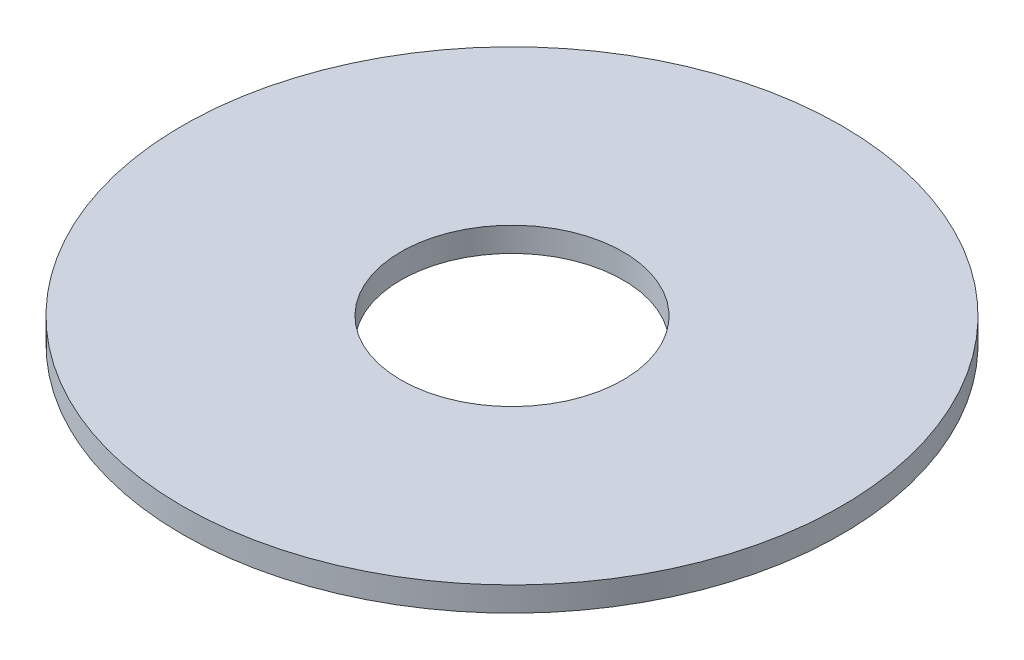
ISO-10303-21;
HEADER;
FILE_DESCRIPTION(('STEP AP214'),'2;1');
FILE_NAME('part.step','',(''),(''),'','','');
FILE_SCHEMA(('AUTOMOTIVE_DESIGN { 1 0 10303 214 1 1 1 1 }'));
ENDSEC;
DATA;
#1=APPLICATION_CONTEXT('core data for automotive mechanical design processes');
#2=APPLICATION_PROTOCOL_DEFINITION('international standard','automotive_design',2000,#1);
#3=PRODUCT_CONTEXT('',#1,'mechanical');
#4=PRODUCT('Part','Part','',(#3));
#5=PRODUCT_RELATED_PRODUCT_CATEGORY('part','',(#4));
#6=PRODUCT_DEFINITION_FORMATION('','',#4);
#7=PRODUCT_DEFINITION_CONTEXT('part definition',#1,'design');
#8=PRODUCT_DEFINITION('design','',#6,#7);
#9=PRODUCT_DEFINITION_SHAPE('','',#8);
#10=(LENGTH_UNIT() NAMED_UNIT(*) SI_UNIT(.MILLI.,.METRE.));
#11=(NAMED_UNIT(*) PLANE_ANGLE_UNIT() SI_UNIT($,.RADIAN.));
#12=(NAMED_UNIT(*) SI_UNIT($,.STERADIAN.) SOLID_ANGLE_UNIT());
#13=UNCERTAINTY_MEASURE_WITH_UNIT(LENGTH_MEASURE(1.E-05),#10,'distance_accuracy_value','');
#14=(GEOMETRIC_REPRESENTATION_CONTEXT(3) GLOBAL_UNCERTAINTY_ASSIGNED_CONTEXT((#13)) GLOBAL_UNIT_ASSIGNED_CONTEXT((#10,
#11,#12)) REPRESENTATION_CONTEXT('',''));
#15=CARTESIAN_POINT('',(0.,0.,0.));
#16=DIRECTION('',(0.,0.,1.));
#17=DIRECTION('',(1.,0.,0.));
#18=AXIS2_PLACEMENT_3D('',#15,#16,#17);
#19=CARTESIAN_POINT('',(0.,0.5842,0.));
#20=DIRECTION('',(0.,-1.,0.));
#21=DIRECTION('',(0.,0.,-1.));
#22=AXIS2_PLACEMENT_3D('',#19,#20,#21);
#23=CYLINDRICAL_SURFACE('',#22,7.874);
#24=CARTESIAN_POINT('',(0.,0.5842,0.));
#25=DIRECTION('',(0.,1.,0.));
#26=DIRECTION('',(0.,0.,1.));
#27=AXIS2_PLACEMENT_3D('',#24,#25,#26);
#28=CIRCLE('',#27,7.874);
#29=CARTESIAN_POINT('',(0.,0.5842,7.874));
#30=VERTEX_POINT('',#29);
#31=EDGE_CURVE('E10',#30,#30,#28,.T.);
#32=ORIENTED_EDGE('',*,*,#31,.F.);
#33=EDGE_LOOP('',(#32));
#34=FACE_BOUND('',#33,.T.);
#35=CARTESIAN_POINT('',(0.,0.,0.));
#36=DIRECTION('',(0.,1.,0.));
#37=DIRECTION('',(0.,0.,1.));
#38=AXIS2_PLACEMENT_3D('',#35,#36,#37);
#39=CIRCLE('',#38,7.874);
#40=CARTESIAN_POINT('',(0.,0.,7.874));
#41=VERTEX_POINT('',#40);
#42=EDGE_CURVE('E33',#41,#41,#39,.T.);
#43=ORIENTED_EDGE('',*,*,#42,.T.);
#44=EDGE_LOOP('',(#43));
#45=FACE_BOUND('',#44,.T.);
#46=ADVANCED_FACE('F30',(#34,#45),#23,.T.);
#47=CARTESIAN_POINT('',(0.,0.5842,0.));
#48=DIRECTION('',(0.,1.,0.));
#49=DIRECTION('',(0.,0.,1.));
#50=AXIS2_PLACEMENT_3D('',#47,#48,#49);
#51=PLANE('',#50);
#52=CARTESIAN_POINT('',(0.,0.5842,0.));
#53=DIRECTION('',(0.,1.,0.));
#54=DIRECTION('',(0.,0.,1.));
#55=AXIS2_PLACEMENT_3D('',#52,#53,#54);
#56=CIRCLE('',#55,2.6543);
#57=CARTESIAN_POINT('',(0.,0.5842,2.6543));
#58=VERTEX_POINT('',#57);
#59=EDGE_CURVE('E42',#58,#58,#56,.T.);
#60=ORIENTED_EDGE('',*,*,#59,.F.);
#61=EDGE_LOOP('',(#60));
#62=FACE_BOUND('',#61,.T.);
#63=ORIENTED_EDGE('',*,*,#31,.T.);
#64=EDGE_LOOP('',(#63));
#65=FACE_BOUND('',#64,.T.);
#66=ADVANCED_FACE('F57',(#62,#65),#51,.T.);
#67=CARTESIAN_POINT('',(0.,0.,0.));
#68=DIRECTION('',(0.,1.,0.));
#69=DIRECTION('',(0.,0.,1.));
#70=AXIS2_PLACEMENT_3D('',#67,#68,#69);
#71=PLANE('',#70);
#72=CARTESIAN_POINT('',(0.,0.,0.));
#73=DIRECTION('',(0.,1.,0.));
#74=DIRECTION('',(0.,0.,1.));
#75=AXIS2_PLACEMENT_3D('',#72,#73,#74);
#76=CIRCLE('',#75,2.6543);
#77=CARTESIAN_POINT('',(0.,0.,2.6543));
#78=VERTEX_POINT('',#77);
#79=EDGE_CURVE('E40',#78,#78,#76,.T.);
#80=ORIENTED_EDGE('',*,*,#79,.T.);
#81=EDGE_LOOP('',(#80));
#82=FACE_BOUND('',#81,.T.);
#83=ORIENTED_EDGE('',*,*,#42,.F.);
#84=EDGE_LOOP('',(#83));
#85=FACE_BOUND('',#84,.T.);
#86=ADVANCED_FACE('F48',(#82,#85),#71,.F.);
#87=CARTESIAN_POINT('',(0.,0.,0.));
#88=DIRECTION('',(0.,1.,0.));
#89=DIRECTION('',(0.,0.,1.));
#90=AXIS2_PLACEMENT_3D('',#87,#88,#89);
#91=CYLINDRICAL_SURFACE('',#90,2.6543);
#92=ORIENTED_EDGE('',*,*,#79,.F.);
#93=EDGE_LOOP('',(#92));
#94=FACE_BOUND('',#93,.T.);
#95=ORIENTED_EDGE('',*,*,#59,.T.);
#96=EDGE_LOOP('',(#95));
#97=FACE_BOUND('',#96,.T.);
#98=ADVANCED_FACE('F51',(#94,#97),#91,.F.);
#99=CLOSED_SHELL('',(#46,#66,#86,#98));
#100=MANIFOLD_SOLID_BREP('B2',#99);
#101=ADVANCED_BREP_SHAPE_REPRESENTATION('',(#18,#100),#14);
#102=SHAPE_DEFINITION_REPRESENTATION(#9,#101);
ENDSEC;
END-ISO-10303-21;
